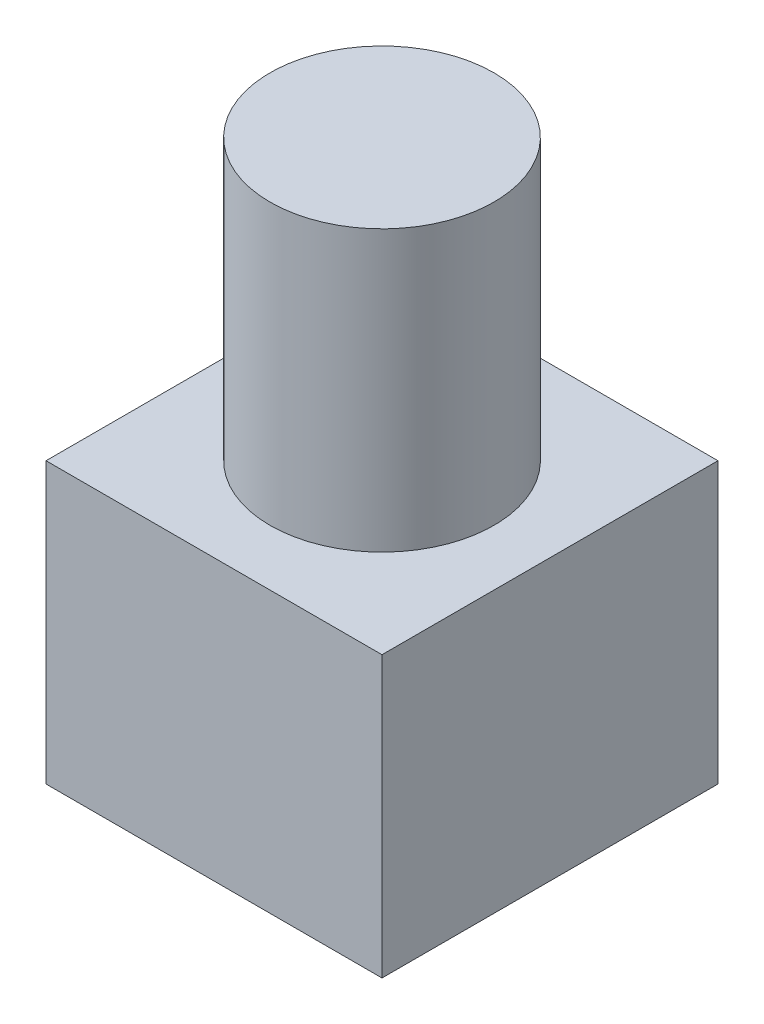
ISO-10303-21;
HEADER;
FILE_DESCRIPTION(('STEP AP214'),'2;1');
FILE_NAME('part.step','',(''),(''),'','','');
FILE_SCHEMA(('AUTOMOTIVE_DESIGN { 1 0 10303 214 1 1 1 1 }'));
ENDSEC;
DATA;
#1=APPLICATION_CONTEXT('core data for automotive mechanical design processes');
#2=APPLICATION_PROTOCOL_DEFINITION('international standard','automotive_design',2000,#1);
#3=PRODUCT_CONTEXT('',#1,'mechanical');
#4=PRODUCT('Part','Part','',(#3));
#5=PRODUCT_RELATED_PRODUCT_CATEGORY('part','',(#4));
#6=PRODUCT_DEFINITION_FORMATION('','',#4);
#7=PRODUCT_DEFINITION_CONTEXT('part definition',#1,'design');
#8=PRODUCT_DEFINITION('design','',#6,#7);
#9=PRODUCT_DEFINITION_SHAPE('','',#8);
#10=(LENGTH_UNIT() NAMED_UNIT(*) SI_UNIT(.MILLI.,.METRE.));
#11=(NAMED_UNIT(*) PLANE_ANGLE_UNIT() SI_UNIT($,.RADIAN.));
#12=(NAMED_UNIT(*) SI_UNIT($,.STERADIAN.) SOLID_ANGLE_UNIT());
#13=UNCERTAINTY_MEASURE_WITH_UNIT(LENGTH_MEASURE(1.E-05),#10,'distance_accuracy_value','');
#14=(GEOMETRIC_REPRESENTATION_CONTEXT(3) GLOBAL_UNCERTAINTY_ASSIGNED_CONTEXT((#13)) GLOBAL_UNIT_ASSIGNED_CONTEXT((#10,
#11,#12)) REPRESENTATION_CONTEXT('',''));
#15=CARTESIAN_POINT('',(0.,0.,0.));
#16=DIRECTION('',(0.,0.,1.));
#17=DIRECTION('',(1.,0.,0.));
#18=AXIS2_PLACEMENT_3D('',#15,#16,#17);
#19=CARTESIAN_POINT('',(0.,5.,0.));
#20=DIRECTION('',(-1.,0.,0.));
#21=DIRECTION('',(0.,0.,1.));
#22=AXIS2_PLACEMENT_3D('',#19,#20,#21);
#23=PLANE('',#22);
#24=DIRECTION('',(0.,0.,-1.));
#25=VECTOR('',#24,1.);
#26=CARTESIAN_POINT('',(0.,0.,0.));
#27=LINE('',#26,#25);
#28=CARTESIAN_POINT('',(0.,0.,0.));
#29=VERTEX_POINT('',#28);
#30=CARTESIAN_POINT('',(0.,0.,-6.));
#31=VERTEX_POINT('',#30);
#32=EDGE_CURVE('E100',#29,#31,#27,.T.);
#33=ORIENTED_EDGE('',*,*,#32,.F.);
#34=DIRECTION('',(0.,-1.,0.));
#35=VECTOR('',#34,1.);
#36=CARTESIAN_POINT('',(0.,5.,0.));
#37=LINE('',#36,#35);
#38=CARTESIAN_POINT('',(0.,5.,0.));
#39=VERTEX_POINT('',#38);
#40=EDGE_CURVE('E42',#39,#29,#37,.T.);
#41=ORIENTED_EDGE('',*,*,#40,.F.);
#42=DIRECTION('',(0.,0.,-1.));
#43=VECTOR('',#42,1.);
#44=CARTESIAN_POINT('',(0.,5.,0.));
#45=LINE('',#44,#43);
#46=CARTESIAN_POINT('',(0.,5.,-6.));
#47=VERTEX_POINT('',#46);
#48=EDGE_CURVE('E95',#39,#47,#45,.T.);
#49=ORIENTED_EDGE('',*,*,#48,.T.);
#50=DIRECTION('',(0.,-1.,0.));
#51=VECTOR('',#50,1.);
#52=CARTESIAN_POINT('',(0.,5.,-6.));
#53=LINE('',#52,#51);
#54=EDGE_CURVE('E36',#47,#31,#53,.T.);
#55=ORIENTED_EDGE('',*,*,#54,.T.);
#56=EDGE_LOOP('',(#33,#41,#49,#55));
#57=FACE_BOUND('',#56,.T.);
#58=ADVANCED_FACE('F33',(#57),#23,.T.);
#59=CARTESIAN_POINT('',(0.,5.,0.));
#60=DIRECTION('',(0.,0.,-1.));
#61=DIRECTION('',(-1.,0.,0.));
#62=AXIS2_PLACEMENT_3D('',#59,#60,#61);
#63=PLANE('',#62);
#64=DIRECTION('',(1.,0.,0.));
#65=VECTOR('',#64,1.);
#66=CARTESIAN_POINT('',(0.,0.,0.));
#67=LINE('',#66,#65);
#68=CARTESIAN_POINT('',(6.,0.,0.));
#69=VERTEX_POINT('',#68);
#70=EDGE_CURVE('E67',#29,#69,#67,.T.);
#71=ORIENTED_EDGE('',*,*,#70,.T.);
#72=DIRECTION('',(0.,-1.,0.));
#73=VECTOR('',#72,1.);
#74=CARTESIAN_POINT('',(6.,5.,0.));
#75=LINE('',#74,#73);
#76=CARTESIAN_POINT('',(6.,5.,0.));
#77=VERTEX_POINT('',#76);
#78=EDGE_CURVE('E93',#77,#69,#75,.T.);
#79=ORIENTED_EDGE('',*,*,#78,.F.);
#80=DIRECTION('',(1.,0.,0.));
#81=VECTOR('',#80,1.);
#82=CARTESIAN_POINT('',(0.,5.,0.));
#83=LINE('',#82,#81);
#84=EDGE_CURVE('E84',#39,#77,#83,.T.);
#85=ORIENTED_EDGE('',*,*,#84,.F.);
#86=ORIENTED_EDGE('',*,*,#40,.T.);
#87=EDGE_LOOP('',(#71,#79,#85,#86));
#88=FACE_BOUND('',#87,.T.);
#89=ADVANCED_FACE('F112',(#88),#63,.F.);
#90=CARTESIAN_POINT('',(6.,5.,0.));
#91=DIRECTION('',(-1.,0.,0.));
#92=DIRECTION('',(0.,0.,1.));
#93=AXIS2_PLACEMENT_3D('',#90,#91,#92);
#94=PLANE('',#93);
#95=DIRECTION('',(0.,0.,-1.));
#96=VECTOR('',#95,1.);
#97=CARTESIAN_POINT('',(6.,0.,0.));
#98=LINE('',#97,#96);
#99=CARTESIAN_POINT('',(6.,0.,-6.));
#100=VERTEX_POINT('',#99);
#101=EDGE_CURVE('E91',#69,#100,#98,.T.);
#102=ORIENTED_EDGE('',*,*,#101,.T.);
#103=DIRECTION('',(0.,-1.,0.));
#104=VECTOR('',#103,1.);
#105=CARTESIAN_POINT('',(6.,5.,-6.));
#106=LINE('',#105,#104);
#107=CARTESIAN_POINT('',(6.,5.,-6.));
#108=VERTEX_POINT('',#107);
#109=EDGE_CURVE('E88',#108,#100,#106,.T.);
#110=ORIENTED_EDGE('',*,*,#109,.F.);
#111=DIRECTION('',(0.,0.,-1.));
#112=VECTOR('',#111,1.);
#113=CARTESIAN_POINT('',(6.,5.,0.));
#114=LINE('',#113,#112);
#115=EDGE_CURVE('E79',#77,#108,#114,.T.);
#116=ORIENTED_EDGE('',*,*,#115,.F.);
#117=ORIENTED_EDGE('',*,*,#78,.T.);
#118=EDGE_LOOP('',(#102,#110,#116,#117));
#119=FACE_BOUND('',#118,.T.);
#120=ADVANCED_FACE('F89',(#119),#94,.F.);
#121=CARTESIAN_POINT('',(0.,5.,-6.));
#122=DIRECTION('',(0.,0.,-1.));
#123=DIRECTION('',(-1.,0.,0.));
#124=AXIS2_PLACEMENT_3D('',#121,#122,#123);
#125=PLANE('',#124);
#126=DIRECTION('',(1.,0.,0.));
#127=VECTOR('',#126,1.);
#128=CARTESIAN_POINT('',(0.,0.,-6.));
#129=LINE('',#128,#127);
#130=EDGE_CURVE('E103',#31,#100,#129,.T.);
#131=ORIENTED_EDGE('',*,*,#130,.F.);
#132=ORIENTED_EDGE('',*,*,#54,.F.);
#133=DIRECTION('',(1.,0.,0.));
#134=VECTOR('',#133,1.);
#135=CARTESIAN_POINT('',(0.,5.,-6.));
#136=LINE('',#135,#134);
#137=EDGE_CURVE('E83',#47,#108,#136,.T.);
#138=ORIENTED_EDGE('',*,*,#137,.T.);
#139=ORIENTED_EDGE('',*,*,#109,.T.);
#140=EDGE_LOOP('',(#131,#132,#138,#139));
#141=FACE_BOUND('',#140,.T.);
#142=ADVANCED_FACE('F94',(#141),#125,.T.);
#143=CARTESIAN_POINT('',(0.,5.,0.));
#144=DIRECTION('',(0.,-1.,0.));
#145=DIRECTION('',(0.,0.,-1.));
#146=AXIS2_PLACEMENT_3D('',#143,#144,#145);
#147=PLANE('',#146);
#148=CARTESIAN_POINT('',(3.,5.,-3.));
#149=DIRECTION('',(0.,1.,0.));
#150=DIRECTION('',(0.,0.,1.));
#151=AXIS2_PLACEMENT_3D('',#148,#149,#150);
#152=CIRCLE('',#151,2.);
#153=CARTESIAN_POINT('',(3.,5.,-1.));
#154=VERTEX_POINT('',#153);
#155=EDGE_CURVE('E11',#154,#154,#152,.T.);
#156=ORIENTED_EDGE('',*,*,#155,.F.);
#157=EDGE_LOOP('',(#156));
#158=FACE_BOUND('',#157,.T.);
#159=ORIENTED_EDGE('',*,*,#48,.F.);
#160=ORIENTED_EDGE('',*,*,#84,.T.);
#161=ORIENTED_EDGE('',*,*,#115,.T.);
#162=ORIENTED_EDGE('',*,*,#137,.F.);
#163=EDGE_LOOP('',(#159,#160,#161,#162));
#164=FACE_BOUND('',#163,.T.);
#165=ADVANCED_FACE('F82',(#158,#164),#147,.F.);
#166=CARTESIAN_POINT('',(0.,0.,0.));
#167=DIRECTION('',(0.,-1.,0.));
#168=DIRECTION('',(0.,0.,-1.));
#169=AXIS2_PLACEMENT_3D('',#166,#167,#168);
#170=PLANE('',#169);
#171=ORIENTED_EDGE('',*,*,#32,.T.);
#172=ORIENTED_EDGE('',*,*,#130,.T.);
#173=ORIENTED_EDGE('',*,*,#101,.F.);
#174=ORIENTED_EDGE('',*,*,#70,.F.);
#175=EDGE_LOOP('',(#171,#172,#173,#174));
#176=FACE_BOUND('',#175,.T.);
#177=ADVANCED_FACE('F110',(#176),#170,.T.);
#178=CARTESIAN_POINT('',(3.,10.,-3.));
#179=DIRECTION('',(0.,-1.,0.));
#180=DIRECTION('',(0.,0.,-1.));
#181=AXIS2_PLACEMENT_3D('',#178,#179,#180);
#182=CYLINDRICAL_SURFACE('',#181,2.);
#183=CARTESIAN_POINT('',(3.,10.,-3.));
#184=DIRECTION('',(0.,1.,0.));
#185=DIRECTION('',(0.,0.,1.));
#186=AXIS2_PLACEMENT_3D('',#183,#184,#185);
#187=CIRCLE('',#186,2.);
#188=CARTESIAN_POINT('',(3.,10.,-1.));
#189=VERTEX_POINT('',#188);
#190=EDGE_CURVE('E104',#189,#189,#187,.T.);
#191=ORIENTED_EDGE('',*,*,#190,.F.);
#192=EDGE_LOOP('',(#191));
#193=FACE_BOUND('',#192,.T.);
#194=ORIENTED_EDGE('',*,*,#155,.T.);
#195=EDGE_LOOP('',(#194));
#196=FACE_BOUND('',#195,.T.);
#197=ADVANCED_FACE('F131',(#193,#196),#182,.T.);
#198=CARTESIAN_POINT('',(3.,10.,-3.));
#199=DIRECTION('',(0.,1.,0.));
#200=DIRECTION('',(0.,0.,1.));
#201=AXIS2_PLACEMENT_3D('',#198,#199,#200);
#202=PLANE('',#201);
#203=ORIENTED_EDGE('',*,*,#190,.T.);
#204=EDGE_LOOP('',(#203));
#205=FACE_BOUND('',#204,.T.);
#206=ADVANCED_FACE('F136',(#205),#202,.T.);
#207=CLOSED_SHELL('',(#58,#89,#120,#142,#165,#177,#197,#206));
#208=MANIFOLD_SOLID_BREP('B2',#207);
#209=ADVANCED_BREP_SHAPE_REPRESENTATION('',(#18,#208),#14);
#210=SHAPE_DEFINITION_REPRESENTATION(#9,#209);
ENDSEC;
END-ISO-10303-21;
